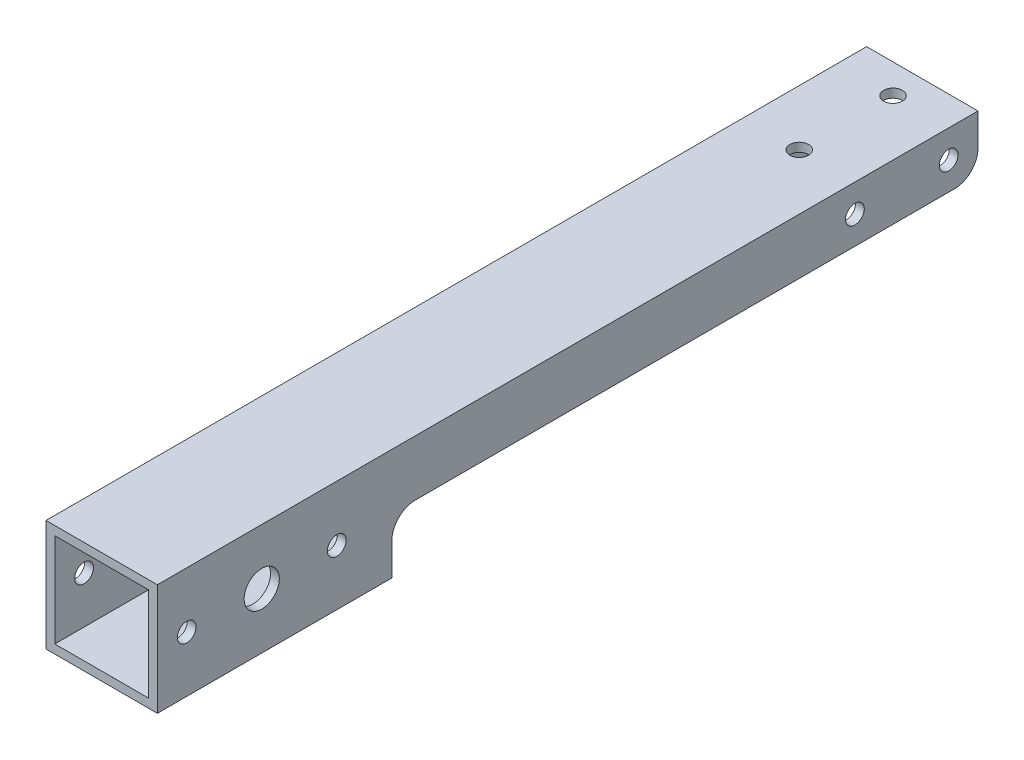
ISO-10303-21;
HEADER;
FILE_DESCRIPTION(('STEP AP214'),'2;1');
FILE_NAME('part.step','',(''),(''),'','','');
FILE_SCHEMA(('AUTOMOTIVE_DESIGN { 1 0 10303 214 1 1 1 1 }'));
ENDSEC;
DATA;
#1=APPLICATION_CONTEXT('core data for automotive mechanical design processes');
#2=APPLICATION_PROTOCOL_DEFINITION('international standard','automotive_design',2000,#1);
#3=PRODUCT_CONTEXT('',#1,'mechanical');
#4=PRODUCT('Part','Part','',(#3));
#5=PRODUCT_RELATED_PRODUCT_CATEGORY('part','',(#4));
#6=PRODUCT_DEFINITION_FORMATION('','',#4);
#7=PRODUCT_DEFINITION_CONTEXT('part definition',#1,'design');
#8=PRODUCT_DEFINITION('design','',#6,#7);
#9=PRODUCT_DEFINITION_SHAPE('','',#8);
#10=(LENGTH_UNIT() NAMED_UNIT(*) SI_UNIT(.MILLI.,.METRE.));
#11=(NAMED_UNIT(*) PLANE_ANGLE_UNIT() SI_UNIT($,.RADIAN.));
#12=(NAMED_UNIT(*) SI_UNIT($,.STERADIAN.) SOLID_ANGLE_UNIT());
#13=UNCERTAINTY_MEASURE_WITH_UNIT(LENGTH_MEASURE(1.E-05),#10,'distance_accuracy_value','');
#14=(GEOMETRIC_REPRESENTATION_CONTEXT(3) GLOBAL_UNCERTAINTY_ASSIGNED_CONTEXT((#13)) GLOBAL_UNIT_ASSIGNED_CONTEXT((#10,
#11,#12)) REPRESENTATION_CONTEXT('',''));
#15=CARTESIAN_POINT('',(0.,0.,0.));
#16=DIRECTION('',(0.,0.,1.));
#17=DIRECTION('',(1.,0.,0.));
#18=AXIS2_PLACEMENT_3D('',#15,#16,#17);
#19=CARTESIAN_POINT('',(-9.5,-9.5,140.));
#20=DIRECTION('',(0.,1.,0.));
#21=DIRECTION('',(0.,0.,1.));
#22=AXIS2_PLACEMENT_3D('',#19,#20,#21);
#23=PLANE('',#22);
#24=DIRECTION('',(1.,0.,0.));
#25=VECTOR('',#24,1.);
#26=CARTESIAN_POINT('',(-9.5,-9.5,100.));
#27=LINE('',#26,#25);
#28=CARTESIAN_POINT('',(-9.5,-9.5,100.));
#29=VERTEX_POINT('',#28);
#30=CARTESIAN_POINT('',(9.5,-9.5,100.));
#31=VERTEX_POINT('',#30);
#32=EDGE_CURVE('E172',#29,#31,#27,.T.);
#33=ORIENTED_EDGE('',*,*,#32,.T.);
#34=DIRECTION('',(0.,0.,-1.));
#35=VECTOR('',#34,1.);
#36=CARTESIAN_POINT('',(9.5,-9.5,140.));
#37=LINE('',#36,#35);
#38=CARTESIAN_POINT('',(9.5,-9.5,140.));
#39=VERTEX_POINT('',#38);
#40=EDGE_CURVE('E182',#39,#31,#37,.T.);
#41=ORIENTED_EDGE('',*,*,#40,.F.);
#42=DIRECTION('',(1.,0.,0.));
#43=VECTOR('',#42,1.);
#44=CARTESIAN_POINT('',(-9.5,-9.5,140.));
#45=LINE('',#44,#43);
#46=CARTESIAN_POINT('',(-9.5,-9.5,140.));
#47=VERTEX_POINT('',#46);
#48=EDGE_CURVE('E202',#47,#39,#45,.T.);
#49=ORIENTED_EDGE('',*,*,#48,.F.);
#50=DIRECTION('',(0.,0.,-1.));
#51=VECTOR('',#50,1.);
#52=CARTESIAN_POINT('',(-9.5,-9.5,140.));
#53=LINE('',#52,#51);
#54=EDGE_CURVE('E184',#47,#29,#53,.T.);
#55=ORIENTED_EDGE('',*,*,#54,.T.);
#56=EDGE_LOOP('',(#33,#41,#49,#55));
#57=FACE_BOUND('',#56,.T.);
#58=ADVANCED_FACE('F58',(#57),#23,.F.);
#59=CARTESIAN_POINT('',(8.,-8.,140.));
#60=DIRECTION('',(0.,-1.,0.));
#61=DIRECTION('',(0.,0.,-1.));
#62=AXIS2_PLACEMENT_3D('',#59,#60,#61);
#63=PLANE('',#62);
#64=DIRECTION('',(1.,0.,0.));
#65=VECTOR('',#64,1.);
#66=CARTESIAN_POINT('',(8.,-8.,100.));
#67=LINE('',#66,#65);
#68=CARTESIAN_POINT('',(-8.,-8.,100.));
#69=VERTEX_POINT('',#68);
#70=CARTESIAN_POINT('',(8.,-8.,100.));
#71=VERTEX_POINT('',#70);
#72=EDGE_CURVE('E268',#69,#71,#67,.T.);
#73=ORIENTED_EDGE('',*,*,#72,.F.);
#74=DIRECTION('',(0.,0.,-1.));
#75=VECTOR('',#74,1.);
#76=CARTESIAN_POINT('',(-8.,-8.,140.));
#77=LINE('',#76,#75);
#78=CARTESIAN_POINT('',(-8.,-8.,140.));
#79=VERTEX_POINT('',#78);
#80=EDGE_CURVE('E359',#79,#69,#77,.T.);
#81=ORIENTED_EDGE('',*,*,#80,.F.);
#82=DIRECTION('',(-1.,0.,0.));
#83=VECTOR('',#82,1.);
#84=CARTESIAN_POINT('',(8.,-8.,140.));
#85=LINE('',#84,#83);
#86=CARTESIAN_POINT('',(8.,-8.,140.));
#87=VERTEX_POINT('',#86);
#88=EDGE_CURVE('E343',#87,#79,#85,.T.);
#89=ORIENTED_EDGE('',*,*,#88,.F.);
#90=DIRECTION('',(0.,0.,-1.));
#91=VECTOR('',#90,1.);
#92=CARTESIAN_POINT('',(8.,-8.,140.));
#93=LINE('',#92,#91);
#94=EDGE_CURVE('E356',#87,#71,#93,.T.);
#95=ORIENTED_EDGE('',*,*,#94,.T.);
#96=EDGE_LOOP('',(#73,#81,#89,#95));
#97=FACE_BOUND('',#96,.T.);
#98=ADVANCED_FACE('F393',(#97),#63,.F.);
#99=CARTESIAN_POINT('',(0.,0.,140.));
#100=DIRECTION('',(0.,0.,-1.));
#101=DIRECTION('',(-1.,0.,0.));
#102=AXIS2_PLACEMENT_3D('',#99,#100,#101);
#103=PLANE('',#102);
#104=DIRECTION('',(0.,1.,0.));
#105=VECTOR('',#104,1.);
#106=CARTESIAN_POINT('',(-9.5,-9.5,140.));
#107=LINE('',#106,#105);
#108=CARTESIAN_POINT('',(-9.5,9.5,140.));
#109=VERTEX_POINT('',#108);
#110=EDGE_CURVE('E365',#47,#109,#107,.T.);
#111=ORIENTED_EDGE('',*,*,#110,.F.);
#112=ORIENTED_EDGE('',*,*,#48,.T.);
#113=DIRECTION('',(0.,1.,0.));
#114=VECTOR('',#113,1.);
#115=CARTESIAN_POINT('',(9.5,-9.5,140.));
#116=LINE('',#115,#114);
#117=CARTESIAN_POINT('',(9.5,9.5,140.));
#118=VERTEX_POINT('',#117);
#119=EDGE_CURVE('E190',#39,#118,#116,.T.);
#120=ORIENTED_EDGE('',*,*,#119,.T.);
#121=DIRECTION('',(1.,0.,0.));
#122=VECTOR('',#121,1.);
#123=CARTESIAN_POINT('',(-9.5,9.5,140.));
#124=LINE('',#123,#122);
#125=EDGE_CURVE('E368',#109,#118,#124,.T.);
#126=ORIENTED_EDGE('',*,*,#125,.F.);
#127=EDGE_LOOP('',(#111,#112,#120,#126));
#128=FACE_BOUND('',#127,.T.);
#129=DIRECTION('',(-1.,0.,0.));
#130=VECTOR('',#129,1.);
#131=CARTESIAN_POINT('',(8.,8.,140.));
#132=LINE('',#131,#130);
#133=CARTESIAN_POINT('',(8.,8.,140.));
#134=VERTEX_POINT('',#133);
#135=CARTESIAN_POINT('',(-8.,8.,140.));
#136=VERTEX_POINT('',#135);
#137=EDGE_CURVE('E337',#134,#136,#132,.T.);
#138=ORIENTED_EDGE('',*,*,#137,.F.);
#139=DIRECTION('',(0.,1.,0.));
#140=VECTOR('',#139,1.);
#141=CARTESIAN_POINT('',(8.,-8.,140.));
#142=LINE('',#141,#140);
#143=EDGE_CURVE('E346',#87,#134,#142,.T.);
#144=ORIENTED_EDGE('',*,*,#143,.F.);
#145=ORIENTED_EDGE('',*,*,#88,.T.);
#146=DIRECTION('',(0.,1.,0.));
#147=VECTOR('',#146,1.);
#148=CARTESIAN_POINT('',(-8.,-8.,140.));
#149=LINE('',#148,#147);
#150=EDGE_CURVE('E339',#79,#136,#149,.T.);
#151=ORIENTED_EDGE('',*,*,#150,.T.);
#152=EDGE_LOOP('',(#138,#144,#145,#151));
#153=FACE_BOUND('',#152,.T.);
#154=ADVANCED_FACE('F390',(#128,#153),#103,.F.);
#155=CARTESIAN_POINT('',(0.,0.,0.));
#156=DIRECTION('',(0.,0.,-1.));
#157=DIRECTION('',(-1.,0.,0.));
#158=AXIS2_PLACEMENT_3D('',#155,#156,#157);
#159=PLANE('',#158);
#160=DIRECTION('',(0.,1.,0.));
#161=VECTOR('',#160,1.);
#162=CARTESIAN_POINT('',(-8.,-8.,0.));
#163=LINE('',#162,#161);
#164=CARTESIAN_POINT('',(-8.,4.,0.));
#165=VERTEX_POINT('',#164);
#166=CARTESIAN_POINT('',(-8.,8.,0.));
#167=VERTEX_POINT('',#166);
#168=EDGE_CURVE('E351',#165,#167,#163,.T.);
#169=ORIENTED_EDGE('',*,*,#168,.F.);
#170=DIRECTION('',(1.,0.,0.));
#171=VECTOR('',#170,1.);
#172=CARTESIAN_POINT('',(-9.5,4.,0.));
#173=LINE('',#172,#171);
#174=CARTESIAN_POINT('',(-9.5,4.,0.));
#175=VERTEX_POINT('',#174);
#176=EDGE_CURVE('E238',#165,#175,#173,.F.);
#177=ORIENTED_EDGE('',*,*,#176,.T.);
#178=DIRECTION('',(0.,1.,0.));
#179=VECTOR('',#178,1.);
#180=CARTESIAN_POINT('',(-9.5,-9.5,0.));
#181=LINE('',#180,#179);
#182=CARTESIAN_POINT('',(-9.5,9.5,0.));
#183=VERTEX_POINT('',#182);
#184=EDGE_CURVE('E364',#175,#183,#181,.T.);
#185=ORIENTED_EDGE('',*,*,#184,.T.);
#186=DIRECTION('',(1.,0.,0.));
#187=VECTOR('',#186,1.);
#188=CARTESIAN_POINT('',(-9.5,9.5,0.));
#189=LINE('',#188,#187);
#190=CARTESIAN_POINT('',(9.5,9.5,0.));
#191=VERTEX_POINT('',#190);
#192=EDGE_CURVE('E375',#183,#191,#189,.T.);
#193=ORIENTED_EDGE('',*,*,#192,.T.);
#194=DIRECTION('',(0.,1.,0.));
#195=VECTOR('',#194,1.);
#196=CARTESIAN_POINT('',(9.5,-9.5,0.));
#197=LINE('',#196,#195);
#198=CARTESIAN_POINT('',(9.5,4.,0.));
#199=VERTEX_POINT('',#198);
#200=EDGE_CURVE('E369',#199,#191,#197,.T.);
#201=ORIENTED_EDGE('',*,*,#200,.F.);
#202=DIRECTION('',(1.,0.,0.));
#203=VECTOR('',#202,1.);
#204=CARTESIAN_POINT('',(8.,4.,0.));
#205=LINE('',#204,#203);
#206=CARTESIAN_POINT('',(8.,4.,0.));
#207=VERTEX_POINT('',#206);
#208=EDGE_CURVE('E236',#199,#207,#205,.F.);
#209=ORIENTED_EDGE('',*,*,#208,.T.);
#210=DIRECTION('',(0.,1.,0.));
#211=VECTOR('',#210,1.);
#212=CARTESIAN_POINT('',(8.,-8.,0.));
#213=LINE('',#212,#211);
#214=CARTESIAN_POINT('',(8.,8.,0.));
#215=VERTEX_POINT('',#214);
#216=EDGE_CURVE('E340',#207,#215,#213,.T.);
#217=ORIENTED_EDGE('',*,*,#216,.T.);
#218=DIRECTION('',(-1.,0.,0.));
#219=VECTOR('',#218,1.);
#220=CARTESIAN_POINT('',(8.,8.,0.));
#221=LINE('',#220,#219);
#222=EDGE_CURVE('E336',#215,#167,#221,.T.);
#223=ORIENTED_EDGE('',*,*,#222,.T.);
#224=EDGE_LOOP('',(#169,#177,#185,#193,#201,#209,#217,#223));
#225=FACE_BOUND('',#224,.T.);
#226=ADVANCED_FACE('F385',(#225),#159,.T.);
#227=CARTESIAN_POINT('',(-9.5,-9.5,140.));
#228=DIRECTION('',(-1.,0.,0.));
#229=DIRECTION('',(0.,0.,1.));
#230=AXIS2_PLACEMENT_3D('',#227,#228,#229);
#231=PLANE('',#230);
#232=ORIENTED_EDGE('',*,*,#184,.F.);
#233=CARTESIAN_POINT('',(-9.5,4.,4.));
#234=DIRECTION('',(-1.,0.,0.));
#235=DIRECTION('',(0.,0.,1.));
#236=AXIS2_PLACEMENT_3D('',#233,#234,#235);
#237=CIRCLE('',#236,4.);
#238=CARTESIAN_POINT('',(-9.5,0.,4.));
#239=VERTEX_POINT('',#238);
#240=EDGE_CURVE('E240',#175,#239,#237,.T.);
#241=ORIENTED_EDGE('',*,*,#240,.T.);
#242=DIRECTION('',(0.,0.,-1.));
#243=VECTOR('',#242,1.);
#244=CARTESIAN_POINT('',(-9.5,0.,161.242645786248));
#245=LINE('',#244,#243);
#246=CARTESIAN_POINT('',(-9.5,0.,96.));
#247=VERTEX_POINT('',#246);
#248=EDGE_CURVE('E263',#247,#239,#245,.T.);
#249=ORIENTED_EDGE('',*,*,#248,.F.);
#250=CARTESIAN_POINT('',(-9.5,-4.,96.));
#251=DIRECTION('',(-1.,0.,0.));
#252=DIRECTION('',(0.,0.,1.));
#253=AXIS2_PLACEMENT_3D('',#250,#251,#252);
#254=CIRCLE('',#253,4.);
#255=CARTESIAN_POINT('',(-9.5,-4.,100.));
#256=VERTEX_POINT('',#255);
#257=EDGE_CURVE('E66',#247,#256,#254,.F.);
#258=ORIENTED_EDGE('',*,*,#257,.T.);
#259=DIRECTION('',(0.,-1.,0.));
#260=VECTOR('',#259,1.);
#261=CARTESIAN_POINT('',(-9.5,-9.5,100.));
#262=LINE('',#261,#260);
#263=EDGE_CURVE('E185',#256,#29,#262,.T.);
#264=ORIENTED_EDGE('',*,*,#263,.T.);
#265=ORIENTED_EDGE('',*,*,#54,.F.);
#266=ORIENTED_EDGE('',*,*,#110,.T.);
#267=DIRECTION('',(0.,0.,-1.));
#268=VECTOR('',#267,1.);
#269=CARTESIAN_POINT('',(-9.5,9.5,140.));
#270=LINE('',#269,#268);
#271=EDGE_CURVE('E196',#109,#183,#270,.T.);
#272=ORIENTED_EDGE('',*,*,#271,.T.);
#273=EDGE_LOOP('',(#232,#241,#249,#258,#264,#265,#266,#272));
#274=FACE_BOUND('',#273,.T.);
#275=CARTESIAN_POINT('',(-9.5,4.75,21.));
#276=DIRECTION('',(1.,0.,0.));
#277=DIRECTION('',(0.,0.,-1.));
#278=AXIS2_PLACEMENT_3D('',#275,#276,#277);
#279=CIRCLE('',#278,1.6);
#280=CARTESIAN_POINT('',(-9.5,4.75,19.4));
#281=VERTEX_POINT('',#280);
#282=EDGE_CURVE('E294',#281,#281,#279,.T.);
#283=ORIENTED_EDGE('',*,*,#282,.T.);
#284=EDGE_LOOP('',(#283));
#285=FACE_BOUND('',#284,.T.);
#286=CARTESIAN_POINT('',(-9.5,4.75,5.));
#287=DIRECTION('',(1.,0.,0.));
#288=DIRECTION('',(0.,0.,-1.));
#289=AXIS2_PLACEMENT_3D('',#286,#287,#288);
#290=CIRCLE('',#289,1.6);
#291=CARTESIAN_POINT('',(-9.5,4.75,3.4));
#292=VERTEX_POINT('',#291);
#293=EDGE_CURVE('E314',#292,#292,#290,.T.);
#294=ORIENTED_EDGE('',*,*,#293,.T.);
#295=EDGE_LOOP('',(#294));
#296=FACE_BOUND('',#295,.T.);
#297=CARTESIAN_POINT('',(-9.5,0.,122.193751525134));
#298=DIRECTION('',(1.,0.,0.));
#299=DIRECTION('',(0.,0.,-1.));
#300=AXIS2_PLACEMENT_3D('',#297,#298,#299);
#301=CIRCLE('',#300,3.00000000000001);
#302=CARTESIAN_POINT('',(-9.5,0.,119.193751525134));
#303=VERTEX_POINT('',#302);
#304=EDGE_CURVE('E308',#303,#303,#301,.T.);
#305=ORIENTED_EDGE('',*,*,#304,.T.);
#306=EDGE_LOOP('',(#305));
#307=FACE_BOUND('',#306,.T.);
#308=CARTESIAN_POINT('',(-9.5,0.,135.));
#309=DIRECTION('',(1.,0.,0.));
#310=DIRECTION('',(0.,0.,-1.));
#311=AXIS2_PLACEMENT_3D('',#308,#309,#310);
#312=CIRCLE('',#311,1.59999999999999);
#313=CARTESIAN_POINT('',(-9.5,0.,133.4));
#314=VERTEX_POINT('',#313);
#315=EDGE_CURVE('E302',#314,#314,#312,.T.);
#316=ORIENTED_EDGE('',*,*,#315,.T.);
#317=EDGE_LOOP('',(#316));
#318=FACE_BOUND('',#317,.T.);
#319=CARTESIAN_POINT('',(-9.5,0.,109.387503050269));
#320=DIRECTION('',(1.,0.,0.));
#321=DIRECTION('',(0.,0.,-1.));
#322=AXIS2_PLACEMENT_3D('',#319,#320,#321);
#323=CIRCLE('',#322,1.60000000000001);
#324=CARTESIAN_POINT('',(-9.5,0.,107.787503050269));
#325=VERTEX_POINT('',#324);
#326=EDGE_CURVE('E207',#325,#325,#323,.T.);
#327=ORIENTED_EDGE('',*,*,#326,.T.);
#328=EDGE_LOOP('',(#327));
#329=FACE_BOUND('',#328,.T.);
#330=ADVANCED_FACE('F260',(#274,#285,#296,#307,#318,#329),#231,.T.);
#331=CARTESIAN_POINT('',(9.5,-9.5,140.));
#332=DIRECTION('',(-1.,0.,0.));
#333=DIRECTION('',(0.,0.,1.));
#334=AXIS2_PLACEMENT_3D('',#331,#332,#333);
#335=PLANE('',#334);
#336=CARTESIAN_POINT('',(9.5,4.75,21.));
#337=DIRECTION('',(1.,0.,0.));
#338=DIRECTION('',(0.,0.,-1.));
#339=AXIS2_PLACEMENT_3D('',#336,#337,#338);
#340=CIRCLE('',#339,1.6);
#341=CARTESIAN_POINT('',(9.5,4.75,19.4));
#342=VERTEX_POINT('',#341);
#343=EDGE_CURVE('E317',#342,#342,#340,.T.);
#344=ORIENTED_EDGE('',*,*,#343,.F.);
#345=EDGE_LOOP('',(#344));
#346=FACE_BOUND('',#345,.T.);
#347=CARTESIAN_POINT('',(9.5,4.75,5.));
#348=DIRECTION('',(1.,0.,0.));
#349=DIRECTION('',(0.,0.,-1.));
#350=AXIS2_PLACEMENT_3D('',#347,#348,#349);
#351=CIRCLE('',#350,1.6);
#352=CARTESIAN_POINT('',(9.5,4.75,3.4));
#353=VERTEX_POINT('',#352);
#354=EDGE_CURVE('E311',#353,#353,#351,.T.);
#355=ORIENTED_EDGE('',*,*,#354,.F.);
#356=EDGE_LOOP('',(#355));
#357=FACE_BOUND('',#356,.T.);
#358=CARTESIAN_POINT('',(9.5,0.,122.193751525134));
#359=DIRECTION('',(1.,0.,0.));
#360=DIRECTION('',(0.,0.,-1.));
#361=AXIS2_PLACEMENT_3D('',#358,#359,#360);
#362=CIRCLE('',#361,3.00000000000001);
#363=CARTESIAN_POINT('',(9.5,0.,119.193751525134));
#364=VERTEX_POINT('',#363);
#365=EDGE_CURVE('E305',#364,#364,#362,.T.);
#366=ORIENTED_EDGE('',*,*,#365,.F.);
#367=EDGE_LOOP('',(#366));
#368=FACE_BOUND('',#367,.T.);
#369=CARTESIAN_POINT('',(9.5,0.,135.));
#370=DIRECTION('',(1.,0.,0.));
#371=DIRECTION('',(0.,0.,-1.));
#372=AXIS2_PLACEMENT_3D('',#369,#370,#371);
#373=CIRCLE('',#372,1.59999999999999);
#374=CARTESIAN_POINT('',(9.5,0.,133.4));
#375=VERTEX_POINT('',#374);
#376=EDGE_CURVE('E298',#375,#375,#373,.T.);
#377=ORIENTED_EDGE('',*,*,#376,.F.);
#378=EDGE_LOOP('',(#377));
#379=FACE_BOUND('',#378,.T.);
#380=CARTESIAN_POINT('',(9.5,0.,109.387503050269));
#381=DIRECTION('',(1.,0.,0.));
#382=DIRECTION('',(0.,0.,-1.));
#383=AXIS2_PLACEMENT_3D('',#380,#381,#382);
#384=CIRCLE('',#383,1.60000000000001);
#385=CARTESIAN_POINT('',(9.5,0.,107.787503050269));
#386=VERTEX_POINT('',#385);
#387=EDGE_CURVE('E301',#386,#386,#384,.T.);
#388=ORIENTED_EDGE('',*,*,#387,.F.);
#389=EDGE_LOOP('',(#388));
#390=FACE_BOUND('',#389,.T.);
#391=DIRECTION('',(0.,0.,-1.));
#392=VECTOR('',#391,1.);
#393=CARTESIAN_POINT('',(9.5,0.,161.242645786248));
#394=LINE('',#393,#392);
#395=CARTESIAN_POINT('',(9.5,0.,96.));
#396=VERTEX_POINT('',#395);
#397=CARTESIAN_POINT('',(9.5,0.,4.));
#398=VERTEX_POINT('',#397);
#399=EDGE_CURVE('E177',#396,#398,#394,.T.);
#400=ORIENTED_EDGE('',*,*,#399,.T.);
#401=CARTESIAN_POINT('',(9.5,4.,4.));
#402=DIRECTION('',(-1.,0.,0.));
#403=DIRECTION('',(0.,0.,1.));
#404=AXIS2_PLACEMENT_3D('',#401,#402,#403);
#405=CIRCLE('',#404,4.);
#406=EDGE_CURVE('E248',#398,#199,#405,.F.);
#407=ORIENTED_EDGE('',*,*,#406,.T.);
#408=ORIENTED_EDGE('',*,*,#200,.T.);
#409=DIRECTION('',(0.,0.,-1.));
#410=VECTOR('',#409,1.);
#411=CARTESIAN_POINT('',(9.5,9.5,140.));
#412=LINE('',#411,#410);
#413=EDGE_CURVE('E191',#118,#191,#412,.T.);
#414=ORIENTED_EDGE('',*,*,#413,.F.);
#415=ORIENTED_EDGE('',*,*,#119,.F.);
#416=ORIENTED_EDGE('',*,*,#40,.T.);
#417=DIRECTION('',(0.,1.,0.));
#418=VECTOR('',#417,1.);
#419=CARTESIAN_POINT('',(9.5,-9.5,100.));
#420=LINE('',#419,#418);
#421=CARTESIAN_POINT('',(9.5,-4.,100.));
#422=VERTEX_POINT('',#421);
#423=EDGE_CURVE('E168',#31,#422,#420,.T.);
#424=ORIENTED_EDGE('',*,*,#423,.T.);
#425=CARTESIAN_POINT('',(9.5,-4.,96.));
#426=DIRECTION('',(-1.,0.,0.));
#427=DIRECTION('',(0.,0.,1.));
#428=AXIS2_PLACEMENT_3D('',#425,#426,#427);
#429=CIRCLE('',#428,4.);
#430=EDGE_CURVE('E256',#422,#396,#429,.T.);
#431=ORIENTED_EDGE('',*,*,#430,.T.);
#432=EDGE_LOOP('',(#400,#407,#408,#414,#415,#416,#424,#431));
#433=FACE_BOUND('',#432,.T.);
#434=ADVANCED_FACE('F188',(#346,#357,#368,#379,#390,#433),#335,.F.);
#435=CARTESIAN_POINT('',(-9.5,9.5,140.));
#436=DIRECTION('',(0.,1.,0.));
#437=DIRECTION('',(0.,0.,1.));
#438=AXIS2_PLACEMENT_3D('',#435,#436,#437);
#439=PLANE('',#438);
#440=CARTESIAN_POINT('',(0.,9.5,21.));
#441=DIRECTION('',(0.,1.,0.));
#442=DIRECTION('',(0.,0.,1.));
#443=AXIS2_PLACEMENT_3D('',#440,#441,#442);
#444=CIRCLE('',#443,1.6);
#445=CARTESIAN_POINT('',(0.,9.5,22.6));
#446=VERTEX_POINT('',#445);
#447=EDGE_CURVE('E289',#446,#446,#444,.T.);
#448=ORIENTED_EDGE('',*,*,#447,.F.);
#449=EDGE_LOOP('',(#448));
#450=FACE_BOUND('',#449,.T.);
#451=CARTESIAN_POINT('',(0.,9.5,5.));
#452=DIRECTION('',(0.,1.,0.));
#453=DIRECTION('',(0.,0.,1.));
#454=AXIS2_PLACEMENT_3D('',#451,#452,#453);
#455=CIRCLE('',#454,1.6);
#456=CARTESIAN_POINT('',(0.,9.5,6.6));
#457=VERTEX_POINT('',#456);
#458=EDGE_CURVE('E281',#457,#457,#455,.T.);
#459=ORIENTED_EDGE('',*,*,#458,.F.);
#460=EDGE_LOOP('',(#459));
#461=FACE_BOUND('',#460,.T.);
#462=ORIENTED_EDGE('',*,*,#192,.F.);
#463=ORIENTED_EDGE('',*,*,#271,.F.);
#464=ORIENTED_EDGE('',*,*,#125,.T.);
#465=ORIENTED_EDGE('',*,*,#413,.T.);
#466=EDGE_LOOP('',(#462,#463,#464,#465));
#467=FACE_BOUND('',#466,.T.);
#468=ADVANCED_FACE('F382',(#450,#461,#467),#439,.T.);
#469=CARTESIAN_POINT('',(8.,8.,140.));
#470=DIRECTION('',(0.,-1.,0.));
#471=DIRECTION('',(0.,0.,-1.));
#472=AXIS2_PLACEMENT_3D('',#469,#470,#471);
#473=PLANE('',#472);
#474=CARTESIAN_POINT('',(0.,8.,21.));
#475=DIRECTION('',(0.,-1.,0.));
#476=DIRECTION('',(0.,0.,-1.));
#477=AXIS2_PLACEMENT_3D('',#474,#475,#476);
#478=CIRCLE('',#477,1.6);
#479=CARTESIAN_POINT('',(0.,8.,19.4));
#480=VERTEX_POINT('',#479);
#481=EDGE_CURVE('E292',#480,#480,#478,.F.);
#482=ORIENTED_EDGE('',*,*,#481,.T.);
#483=EDGE_LOOP('',(#482));
#484=FACE_BOUND('',#483,.T.);
#485=CARTESIAN_POINT('',(0.,8.,5.));
#486=DIRECTION('',(0.,-1.,0.));
#487=DIRECTION('',(0.,0.,-1.));
#488=AXIS2_PLACEMENT_3D('',#485,#486,#487);
#489=CIRCLE('',#488,1.6);
#490=CARTESIAN_POINT('',(0.,8.,3.4));
#491=VERTEX_POINT('',#490);
#492=EDGE_CURVE('E284',#491,#491,#489,.F.);
#493=ORIENTED_EDGE('',*,*,#492,.T.);
#494=EDGE_LOOP('',(#493));
#495=FACE_BOUND('',#494,.T.);
#496=ORIENTED_EDGE('',*,*,#222,.F.);
#497=DIRECTION('',(0.,0.,-1.));
#498=VECTOR('',#497,1.);
#499=CARTESIAN_POINT('',(8.,8.,140.));
#500=LINE('',#499,#498);
#501=EDGE_CURVE('E348',#134,#215,#500,.T.);
#502=ORIENTED_EDGE('',*,*,#501,.F.);
#503=ORIENTED_EDGE('',*,*,#137,.T.);
#504=DIRECTION('',(0.,0.,-1.));
#505=VECTOR('',#504,1.);
#506=CARTESIAN_POINT('',(-8.,8.,140.));
#507=LINE('',#506,#505);
#508=EDGE_CURVE('E361',#136,#167,#507,.T.);
#509=ORIENTED_EDGE('',*,*,#508,.T.);
#510=EDGE_LOOP('',(#496,#502,#503,#509));
#511=FACE_BOUND('',#510,.T.);
#512=ADVANCED_FACE('F402',(#484,#495,#511),#473,.T.);
#513=CARTESIAN_POINT('',(-8.,-8.,140.));
#514=DIRECTION('',(-1.,0.,0.));
#515=DIRECTION('',(0.,0.,1.));
#516=AXIS2_PLACEMENT_3D('',#513,#514,#515);
#517=PLANE('',#516);
#518=CARTESIAN_POINT('',(-8.,4.75,21.));
#519=DIRECTION('',(-1.,0.,0.));
#520=DIRECTION('',(0.,0.,1.));
#521=AXIS2_PLACEMENT_3D('',#518,#519,#520);
#522=CIRCLE('',#521,1.6);
#523=CARTESIAN_POINT('',(-8.,4.75,22.6));
#524=VERTEX_POINT('',#523);
#525=EDGE_CURVE('E223',#524,#524,#522,.T.);
#526=ORIENTED_EDGE('',*,*,#525,.T.);
#527=EDGE_LOOP('',(#526));
#528=FACE_BOUND('',#527,.T.);
#529=CARTESIAN_POINT('',(-8.,4.75,5.));
#530=DIRECTION('',(-1.,0.,0.));
#531=DIRECTION('',(0.,0.,1.));
#532=AXIS2_PLACEMENT_3D('',#529,#530,#531);
#533=CIRCLE('',#532,1.6);
#534=CARTESIAN_POINT('',(-8.,4.75,6.6));
#535=VERTEX_POINT('',#534);
#536=EDGE_CURVE('E219',#535,#535,#533,.T.);
#537=ORIENTED_EDGE('',*,*,#536,.T.);
#538=EDGE_LOOP('',(#537));
#539=FACE_BOUND('',#538,.T.);
#540=CARTESIAN_POINT('',(-8.,0.,122.193751525134));
#541=DIRECTION('',(-1.,0.,0.));
#542=DIRECTION('',(0.,0.,1.));
#543=AXIS2_PLACEMENT_3D('',#540,#541,#542);
#544=CIRCLE('',#543,3.00000000000001);
#545=CARTESIAN_POINT('',(-8.,0.,125.193751525134));
#546=VERTEX_POINT('',#545);
#547=EDGE_CURVE('E215',#546,#546,#544,.T.);
#548=ORIENTED_EDGE('',*,*,#547,.T.);
#549=EDGE_LOOP('',(#548));
#550=FACE_BOUND('',#549,.T.);
#551=CARTESIAN_POINT('',(-8.,0.,135.));
#552=DIRECTION('',(-1.,0.,0.));
#553=DIRECTION('',(0.,0.,1.));
#554=AXIS2_PLACEMENT_3D('',#551,#552,#553);
#555=CIRCLE('',#554,1.59999999999999);
#556=CARTESIAN_POINT('',(-8.,0.,136.6));
#557=VERTEX_POINT('',#556);
#558=EDGE_CURVE('E211',#557,#557,#555,.T.);
#559=ORIENTED_EDGE('',*,*,#558,.T.);
#560=EDGE_LOOP('',(#559));
#561=FACE_BOUND('',#560,.T.);
#562=CARTESIAN_POINT('',(-8.,0.,109.387503050269));
#563=DIRECTION('',(-1.,0.,0.));
#564=DIRECTION('',(0.,0.,1.));
#565=AXIS2_PLACEMENT_3D('',#562,#563,#564);
#566=CIRCLE('',#565,1.60000000000001);
#567=CARTESIAN_POINT('',(-8.,0.,110.987503050269));
#568=VERTEX_POINT('',#567);
#569=EDGE_CURVE('E206',#568,#568,#566,.T.);
#570=ORIENTED_EDGE('',*,*,#569,.T.);
#571=EDGE_LOOP('',(#570));
#572=FACE_BOUND('',#571,.T.);
#573=DIRECTION('',(0.,0.,-1.));
#574=VECTOR('',#573,1.);
#575=CARTESIAN_POINT('',(-8.,0.,140.));
#576=LINE('',#575,#574);
#577=CARTESIAN_POINT('',(-8.,0.,96.));
#578=VERTEX_POINT('',#577);
#579=CARTESIAN_POINT('',(-8.,0.,4.));
#580=VERTEX_POINT('',#579);
#581=EDGE_CURVE('E275',#578,#580,#576,.T.);
#582=ORIENTED_EDGE('',*,*,#581,.T.);
#583=CARTESIAN_POINT('',(-8.,4.,4.));
#584=DIRECTION('',(-1.,0.,0.));
#585=DIRECTION('',(0.,0.,1.));
#586=AXIS2_PLACEMENT_3D('',#583,#584,#585);
#587=CIRCLE('',#586,4.);
#588=EDGE_CURVE('E234',#580,#165,#587,.F.);
#589=ORIENTED_EDGE('',*,*,#588,.T.);
#590=ORIENTED_EDGE('',*,*,#168,.T.);
#591=ORIENTED_EDGE('',*,*,#508,.F.);
#592=ORIENTED_EDGE('',*,*,#150,.F.);
#593=ORIENTED_EDGE('',*,*,#80,.T.);
#594=DIRECTION('',(0.,-1.,0.));
#595=VECTOR('',#594,1.);
#596=CARTESIAN_POINT('',(-8.,-8.,100.));
#597=LINE('',#596,#595);
#598=CARTESIAN_POINT('',(-8.,-4.,100.));
#599=VERTEX_POINT('',#598);
#600=EDGE_CURVE('E277',#599,#69,#597,.T.);
#601=ORIENTED_EDGE('',*,*,#600,.F.);
#602=CARTESIAN_POINT('',(-8.,-4.,96.));
#603=DIRECTION('',(-1.,0.,0.));
#604=DIRECTION('',(0.,0.,1.));
#605=AXIS2_PLACEMENT_3D('',#602,#603,#604);
#606=CIRCLE('',#605,4.);
#607=EDGE_CURVE('E13',#599,#578,#606,.T.);
#608=ORIENTED_EDGE('',*,*,#607,.T.);
#609=EDGE_LOOP('',(#582,#589,#590,#591,#592,#593,#601,#608));
#610=FACE_BOUND('',#609,.T.);
#611=ADVANCED_FACE('F274',(#528,#539,#550,#561,#572,#610),#517,.F.);
#612=CARTESIAN_POINT('',(8.,-8.,140.));
#613=DIRECTION('',(-1.,0.,0.));
#614=DIRECTION('',(0.,0.,1.));
#615=AXIS2_PLACEMENT_3D('',#612,#613,#614);
#616=PLANE('',#615);
#617=ORIENTED_EDGE('',*,*,#216,.F.);
#618=CARTESIAN_POINT('',(8.,4.,4.));
#619=DIRECTION('',(-1.,0.,0.));
#620=DIRECTION('',(0.,0.,1.));
#621=AXIS2_PLACEMENT_3D('',#618,#619,#620);
#622=CIRCLE('',#621,4.);
#623=CARTESIAN_POINT('',(8.,0.,4.));
#624=VERTEX_POINT('',#623);
#625=EDGE_CURVE('E250',#207,#624,#622,.T.);
#626=ORIENTED_EDGE('',*,*,#625,.T.);
#627=DIRECTION('',(0.,0.,-1.));
#628=VECTOR('',#627,1.);
#629=CARTESIAN_POINT('',(8.,0.,140.));
#630=LINE('',#629,#628);
#631=CARTESIAN_POINT('',(8.,0.,96.));
#632=VERTEX_POINT('',#631);
#633=EDGE_CURVE('E225',#632,#624,#630,.T.);
#634=ORIENTED_EDGE('',*,*,#633,.F.);
#635=CARTESIAN_POINT('',(8.,-4.,96.));
#636=DIRECTION('',(-1.,0.,0.));
#637=DIRECTION('',(0.,0.,1.));
#638=AXIS2_PLACEMENT_3D('',#635,#636,#637);
#639=CIRCLE('',#638,4.);
#640=CARTESIAN_POINT('',(8.,-4.,100.));
#641=VERTEX_POINT('',#640);
#642=EDGE_CURVE('E73',#632,#641,#639,.F.);
#643=ORIENTED_EDGE('',*,*,#642,.T.);
#644=DIRECTION('',(0.,-1.,0.));
#645=VECTOR('',#644,1.);
#646=CARTESIAN_POINT('',(8.,-8.,100.));
#647=LINE('',#646,#645);
#648=EDGE_CURVE('E193',#641,#71,#647,.T.);
#649=ORIENTED_EDGE('',*,*,#648,.T.);
#650=ORIENTED_EDGE('',*,*,#94,.F.);
#651=ORIENTED_EDGE('',*,*,#143,.T.);
#652=ORIENTED_EDGE('',*,*,#501,.T.);
#653=EDGE_LOOP('',(#617,#626,#634,#643,#649,#650,#651,#652));
#654=FACE_BOUND('',#653,.T.);
#655=CARTESIAN_POINT('',(8.,4.75,21.));
#656=DIRECTION('',(-1.,0.,0.));
#657=DIRECTION('',(0.,0.,1.));
#658=AXIS2_PLACEMENT_3D('',#655,#656,#657);
#659=CIRCLE('',#658,1.6);
#660=CARTESIAN_POINT('',(8.,4.75,22.6));
#661=VERTEX_POINT('',#660);
#662=EDGE_CURVE('E220',#661,#661,#659,.T.);
#663=ORIENTED_EDGE('',*,*,#662,.F.);
#664=EDGE_LOOP('',(#663));
#665=FACE_BOUND('',#664,.T.);
#666=CARTESIAN_POINT('',(8.,4.75,5.));
#667=DIRECTION('',(-1.,0.,0.));
#668=DIRECTION('',(0.,0.,1.));
#669=AXIS2_PLACEMENT_3D('',#666,#667,#668);
#670=CIRCLE('',#669,1.6);
#671=CARTESIAN_POINT('',(8.,4.75,6.6));
#672=VERTEX_POINT('',#671);
#673=EDGE_CURVE('E216',#672,#672,#670,.T.);
#674=ORIENTED_EDGE('',*,*,#673,.F.);
#675=EDGE_LOOP('',(#674));
#676=FACE_BOUND('',#675,.T.);
#677=CARTESIAN_POINT('',(8.,0.,122.193751525134));
#678=DIRECTION('',(-1.,0.,0.));
#679=DIRECTION('',(0.,0.,1.));
#680=AXIS2_PLACEMENT_3D('',#677,#678,#679);
#681=CIRCLE('',#680,3.00000000000001);
#682=CARTESIAN_POINT('',(8.,0.,125.193751525134));
#683=VERTEX_POINT('',#682);
#684=EDGE_CURVE('E212',#683,#683,#681,.T.);
#685=ORIENTED_EDGE('',*,*,#684,.F.);
#686=EDGE_LOOP('',(#685));
#687=FACE_BOUND('',#686,.T.);
#688=CARTESIAN_POINT('',(8.,0.,135.));
#689=DIRECTION('',(-1.,0.,0.));
#690=DIRECTION('',(0.,0.,1.));
#691=AXIS2_PLACEMENT_3D('',#688,#689,#690);
#692=CIRCLE('',#691,1.59999999999999);
#693=CARTESIAN_POINT('',(8.,0.,136.6));
#694=VERTEX_POINT('',#693);
#695=EDGE_CURVE('E208',#694,#694,#692,.T.);
#696=ORIENTED_EDGE('',*,*,#695,.F.);
#697=EDGE_LOOP('',(#696));
#698=FACE_BOUND('',#697,.T.);
#699=CARTESIAN_POINT('',(8.,0.,109.387503050269));
#700=DIRECTION('',(-1.,0.,0.));
#701=DIRECTION('',(0.,0.,1.));
#702=AXIS2_PLACEMENT_3D('',#699,#700,#701);
#703=CIRCLE('',#702,1.60000000000001);
#704=CARTESIAN_POINT('',(8.,0.,110.987503050269));
#705=VERTEX_POINT('',#704);
#706=EDGE_CURVE('E203',#705,#705,#703,.T.);
#707=ORIENTED_EDGE('',*,*,#706,.F.);
#708=EDGE_LOOP('',(#707));
#709=FACE_BOUND('',#708,.T.);
#710=ADVANCED_FACE('F412',(#654,#665,#676,#687,#698,#709),#616,.T.);
#711=CARTESIAN_POINT('',(-9.5,0.,109.387503050269));
#712=DIRECTION('',(1.,0.,0.));
#713=DIRECTION('',(0.,0.,-1.));
#714=AXIS2_PLACEMENT_3D('',#711,#712,#713);
#715=CYLINDRICAL_SURFACE('',#714,1.60000000000001);
#716=ORIENTED_EDGE('',*,*,#706,.T.);
#717=EDGE_LOOP('',(#716));
#718=FACE_BOUND('',#717,.T.);
#719=ORIENTED_EDGE('',*,*,#387,.T.);
#720=EDGE_LOOP('',(#719));
#721=FACE_BOUND('',#720,.T.);
#722=ADVANCED_FACE('F475',(#718,#721),#715,.F.);
#723=CARTESIAN_POINT('',(-9.5,0.,135.));
#724=DIRECTION('',(1.,0.,0.));
#725=DIRECTION('',(0.,0.,-1.));
#726=AXIS2_PLACEMENT_3D('',#723,#724,#725);
#727=CYLINDRICAL_SURFACE('',#726,1.59999999999999);
#728=ORIENTED_EDGE('',*,*,#695,.T.);
#729=EDGE_LOOP('',(#728));
#730=FACE_BOUND('',#729,.T.);
#731=ORIENTED_EDGE('',*,*,#376,.T.);
#732=EDGE_LOOP('',(#731));
#733=FACE_BOUND('',#732,.T.);
#734=ADVANCED_FACE('F471',(#730,#733),#727,.F.);
#735=CARTESIAN_POINT('',(-9.5,0.,122.193751525134));
#736=DIRECTION('',(1.,0.,0.));
#737=DIRECTION('',(0.,0.,-1.));
#738=AXIS2_PLACEMENT_3D('',#735,#736,#737);
#739=CYLINDRICAL_SURFACE('',#738,3.00000000000001);
#740=ORIENTED_EDGE('',*,*,#684,.T.);
#741=EDGE_LOOP('',(#740));
#742=FACE_BOUND('',#741,.T.);
#743=ORIENTED_EDGE('',*,*,#365,.T.);
#744=EDGE_LOOP('',(#743));
#745=FACE_BOUND('',#744,.T.);
#746=ADVANCED_FACE('F474',(#742,#745),#739,.F.);
#747=CARTESIAN_POINT('',(-9.5,4.75,5.));
#748=DIRECTION('',(1.,0.,0.));
#749=DIRECTION('',(0.,0.,-1.));
#750=AXIS2_PLACEMENT_3D('',#747,#748,#749);
#751=CYLINDRICAL_SURFACE('',#750,1.6);
#752=ORIENTED_EDGE('',*,*,#673,.T.);
#753=EDGE_LOOP('',(#752));
#754=FACE_BOUND('',#753,.T.);
#755=ORIENTED_EDGE('',*,*,#354,.T.);
#756=EDGE_LOOP('',(#755));
#757=FACE_BOUND('',#756,.T.);
#758=ADVANCED_FACE('F480',(#754,#757),#751,.F.);
#759=CARTESIAN_POINT('',(-9.5,4.75,21.));
#760=DIRECTION('',(1.,0.,0.));
#761=DIRECTION('',(0.,0.,-1.));
#762=AXIS2_PLACEMENT_3D('',#759,#760,#761);
#763=CYLINDRICAL_SURFACE('',#762,1.6);
#764=ORIENTED_EDGE('',*,*,#662,.T.);
#765=EDGE_LOOP('',(#764));
#766=FACE_BOUND('',#765,.T.);
#767=ORIENTED_EDGE('',*,*,#343,.T.);
#768=EDGE_LOOP('',(#767));
#769=FACE_BOUND('',#768,.T.);
#770=ADVANCED_FACE('F485',(#766,#769),#763,.F.);
#771=ORIENTED_EDGE('',*,*,#326,.F.);
#772=EDGE_LOOP('',(#771));
#773=FACE_BOUND('',#772,.T.);
#774=ORIENTED_EDGE('',*,*,#569,.F.);
#775=EDGE_LOOP('',(#774));
#776=FACE_BOUND('',#775,.T.);
#777=ADVANCED_FACE('F490',(#773,#776),#715,.F.);
#778=ORIENTED_EDGE('',*,*,#315,.F.);
#779=EDGE_LOOP('',(#778));
#780=FACE_BOUND('',#779,.T.);
#781=ORIENTED_EDGE('',*,*,#558,.F.);
#782=EDGE_LOOP('',(#781));
#783=FACE_BOUND('',#782,.T.);
#784=ADVANCED_FACE('F477',(#780,#783),#727,.F.);
#785=ORIENTED_EDGE('',*,*,#304,.F.);
#786=EDGE_LOOP('',(#785));
#787=FACE_BOUND('',#786,.T.);
#788=ORIENTED_EDGE('',*,*,#547,.F.);
#789=EDGE_LOOP('',(#788));
#790=FACE_BOUND('',#789,.T.);
#791=ADVANCED_FACE('F482',(#787,#790),#739,.F.);
#792=ORIENTED_EDGE('',*,*,#293,.F.);
#793=EDGE_LOOP('',(#792));
#794=FACE_BOUND('',#793,.T.);
#795=ORIENTED_EDGE('',*,*,#536,.F.);
#796=EDGE_LOOP('',(#795));
#797=FACE_BOUND('',#796,.T.);
#798=ADVANCED_FACE('F487',(#794,#797),#751,.F.);
#799=ORIENTED_EDGE('',*,*,#282,.F.);
#800=EDGE_LOOP('',(#799));
#801=FACE_BOUND('',#800,.T.);
#802=ORIENTED_EDGE('',*,*,#525,.F.);
#803=EDGE_LOOP('',(#802));
#804=FACE_BOUND('',#803,.T.);
#805=ADVANCED_FACE('F466',(#801,#804),#763,.F.);
#806=CARTESIAN_POINT('',(0.,3.47451660040609,5.));
#807=DIRECTION('',(0.,1.,0.));
#808=DIRECTION('',(0.,0.,1.));
#809=AXIS2_PLACEMENT_3D('',#806,#807,#808);
#810=CYLINDRICAL_SURFACE('',#809,1.6);
#811=ORIENTED_EDGE('',*,*,#458,.T.);
#812=EDGE_LOOP('',(#811));
#813=FACE_BOUND('',#812,.T.);
#814=ORIENTED_EDGE('',*,*,#492,.F.);
#815=EDGE_LOOP('',(#814));
#816=FACE_BOUND('',#815,.T.);
#817=ADVANCED_FACE('F461',(#813,#816),#810,.F.);
#818=CARTESIAN_POINT('',(0.,3.47451660040609,21.));
#819=DIRECTION('',(0.,1.,0.));
#820=DIRECTION('',(0.,0.,1.));
#821=AXIS2_PLACEMENT_3D('',#818,#819,#820);
#822=CYLINDRICAL_SURFACE('',#821,1.6);
#823=ORIENTED_EDGE('',*,*,#447,.T.);
#824=EDGE_LOOP('',(#823));
#825=FACE_BOUND('',#824,.T.);
#826=ORIENTED_EDGE('',*,*,#481,.F.);
#827=EDGE_LOOP('',(#826));
#828=FACE_BOUND('',#827,.T.);
#829=ADVANCED_FACE('F457',(#825,#828),#822,.F.);
#830=CARTESIAN_POINT('',(-9.5,0.,161.242645786248));
#831=DIRECTION('',(0.,1.,0.));
#832=DIRECTION('',(-1.,0.,0.));
#833=AXIS2_PLACEMENT_3D('',#830,#831,#832);
#834=PLANE('',#833);
#835=ORIENTED_EDGE('',*,*,#248,.T.);
#836=DIRECTION('',(1.,0.,0.));
#837=VECTOR('',#836,1.);
#838=CARTESIAN_POINT('',(-8.,0.,4.));
#839=LINE('',#838,#837);
#840=EDGE_CURVE('E231',#239,#580,#839,.T.);
#841=ORIENTED_EDGE('',*,*,#840,.T.);
#842=ORIENTED_EDGE('',*,*,#581,.F.);
#843=DIRECTION('',(-1.,0.,0.));
#844=VECTOR('',#843,1.);
#845=CARTESIAN_POINT('',(-9.5,0.,96.));
#846=LINE('',#845,#844);
#847=EDGE_CURVE('E228',#578,#247,#846,.T.);
#848=ORIENTED_EDGE('',*,*,#847,.T.);
#849=EDGE_LOOP('',(#835,#841,#842,#848));
#850=FACE_BOUND('',#849,.T.);
#851=ADVANCED_FACE('F279',(#850),#834,.F.);
#852=CARTESIAN_POINT('',(0.,0.,100.));
#853=DIRECTION('',(0.,0.,-1.));
#854=DIRECTION('',(-1.,0.,0.));
#855=AXIS2_PLACEMENT_3D('',#852,#853,#854);
#856=PLANE('',#855);
#857=ORIENTED_EDGE('',*,*,#648,.F.);
#858=DIRECTION('',(-1.,0.,0.));
#859=VECTOR('',#858,1.);
#860=CARTESIAN_POINT('',(0.,-4.,100.));
#861=LINE('',#860,#859);
#862=EDGE_CURVE('E80',#641,#422,#861,.F.);
#863=ORIENTED_EDGE('',*,*,#862,.T.);
#864=ORIENTED_EDGE('',*,*,#423,.F.);
#865=ORIENTED_EDGE('',*,*,#32,.F.);
#866=ORIENTED_EDGE('',*,*,#263,.F.);
#867=DIRECTION('',(-1.,0.,0.));
#868=VECTOR('',#867,1.);
#869=CARTESIAN_POINT('',(0.,-4.,100.));
#870=LINE('',#869,#868);
#871=EDGE_CURVE('E252',#256,#599,#870,.F.);
#872=ORIENTED_EDGE('',*,*,#871,.T.);
#873=ORIENTED_EDGE('',*,*,#600,.T.);
#874=ORIENTED_EDGE('',*,*,#72,.T.);
#875=EDGE_LOOP('',(#857,#863,#864,#865,#866,#872,#873,#874));
#876=FACE_BOUND('',#875,.T.);
#877=ADVANCED_FACE('F170',(#876),#856,.T.);
#878=ORIENTED_EDGE('',*,*,#633,.T.);
#879=DIRECTION('',(1.,0.,0.));
#880=VECTOR('',#879,1.);
#881=CARTESIAN_POINT('',(9.5,0.,4.));
#882=LINE('',#881,#880);
#883=EDGE_CURVE('E245',#624,#398,#882,.T.);
#884=ORIENTED_EDGE('',*,*,#883,.T.);
#885=ORIENTED_EDGE('',*,*,#399,.F.);
#886=DIRECTION('',(-1.,0.,0.));
#887=VECTOR('',#886,1.);
#888=CARTESIAN_POINT('',(-9.5,0.,96.));
#889=LINE('',#888,#887);
#890=EDGE_CURVE('E242',#396,#632,#889,.T.);
#891=ORIENTED_EDGE('',*,*,#890,.T.);
#892=EDGE_LOOP('',(#878,#884,#885,#891));
#893=FACE_BOUND('',#892,.T.);
#894=ADVANCED_FACE('F420',(#893),#834,.F.);
#895=CARTESIAN_POINT('',(-9.5,4.,4.));
#896=DIRECTION('',(-1.,0.,0.));
#897=DIRECTION('',(0.,-1.,0.));
#898=AXIS2_PLACEMENT_3D('',#895,#896,#897);
#899=CYLINDRICAL_SURFACE('',#898,4.);
#900=ORIENTED_EDGE('',*,*,#240,.F.);
#901=ORIENTED_EDGE('',*,*,#176,.F.);
#902=ORIENTED_EDGE('',*,*,#588,.F.);
#903=ORIENTED_EDGE('',*,*,#840,.F.);
#904=EDGE_LOOP('',(#900,#901,#902,#903));
#905=FACE_BOUND('',#904,.T.);
#906=ADVANCED_FACE('F404',(#905),#899,.T.);
#907=CARTESIAN_POINT('',(-9.5,4.,4.));
#908=DIRECTION('',(-1.,0.,0.));
#909=DIRECTION('',(0.,-1.,0.));
#910=AXIS2_PLACEMENT_3D('',#907,#908,#909);
#911=CYLINDRICAL_SURFACE('',#910,4.);
#912=ORIENTED_EDGE('',*,*,#625,.F.);
#913=ORIENTED_EDGE('',*,*,#208,.F.);
#914=ORIENTED_EDGE('',*,*,#406,.F.);
#915=ORIENTED_EDGE('',*,*,#883,.F.);
#916=EDGE_LOOP('',(#912,#913,#914,#915));
#917=FACE_BOUND('',#916,.T.);
#918=ADVANCED_FACE('F417',(#917),#911,.T.);
#919=CARTESIAN_POINT('',(-9.5,-4.,96.));
#920=DIRECTION('',(-1.,0.,0.));
#921=DIRECTION('',(0.,-1.,0.));
#922=AXIS2_PLACEMENT_3D('',#919,#920,#921);
#923=CYLINDRICAL_SURFACE('',#922,4.);
#924=ORIENTED_EDGE('',*,*,#430,.F.);
#925=ORIENTED_EDGE('',*,*,#862,.F.);
#926=ORIENTED_EDGE('',*,*,#642,.F.);
#927=ORIENTED_EDGE('',*,*,#890,.F.);
#928=EDGE_LOOP('',(#924,#925,#926,#927));
#929=FACE_BOUND('',#928,.T.);
#930=ADVANCED_FACE('F423',(#929),#923,.F.);
#931=CARTESIAN_POINT('',(-9.5,-4.,96.));
#932=DIRECTION('',(-1.,0.,0.));
#933=DIRECTION('',(0.,-1.,0.));
#934=AXIS2_PLACEMENT_3D('',#931,#932,#933);
#935=CYLINDRICAL_SURFACE('',#934,4.);
#936=ORIENTED_EDGE('',*,*,#607,.F.);
#937=ORIENTED_EDGE('',*,*,#871,.F.);
#938=ORIENTED_EDGE('',*,*,#257,.F.);
#939=ORIENTED_EDGE('',*,*,#847,.F.);
#940=EDGE_LOOP('',(#936,#937,#938,#939));
#941=FACE_BOUND('',#940,.T.);
#942=ADVANCED_FACE('F60',(#941),#935,.F.);
#943=CLOSED_SHELL('',(#58,#98,#154,#226,#330,#434,#468,#512,#611,#710,#722,#734,#746,#758,#770,
#777,#784,#791,#798,#805,#817,#829,#851,#877,#894,#906,#918,#930,#942));
#944=MANIFOLD_SOLID_BREP('B2',#943);
#945=ADVANCED_BREP_SHAPE_REPRESENTATION('',(#18,#944),#14);
#946=SHAPE_DEFINITION_REPRESENTATION(#9,#945);
ENDSEC;
END-ISO-10303-21;
